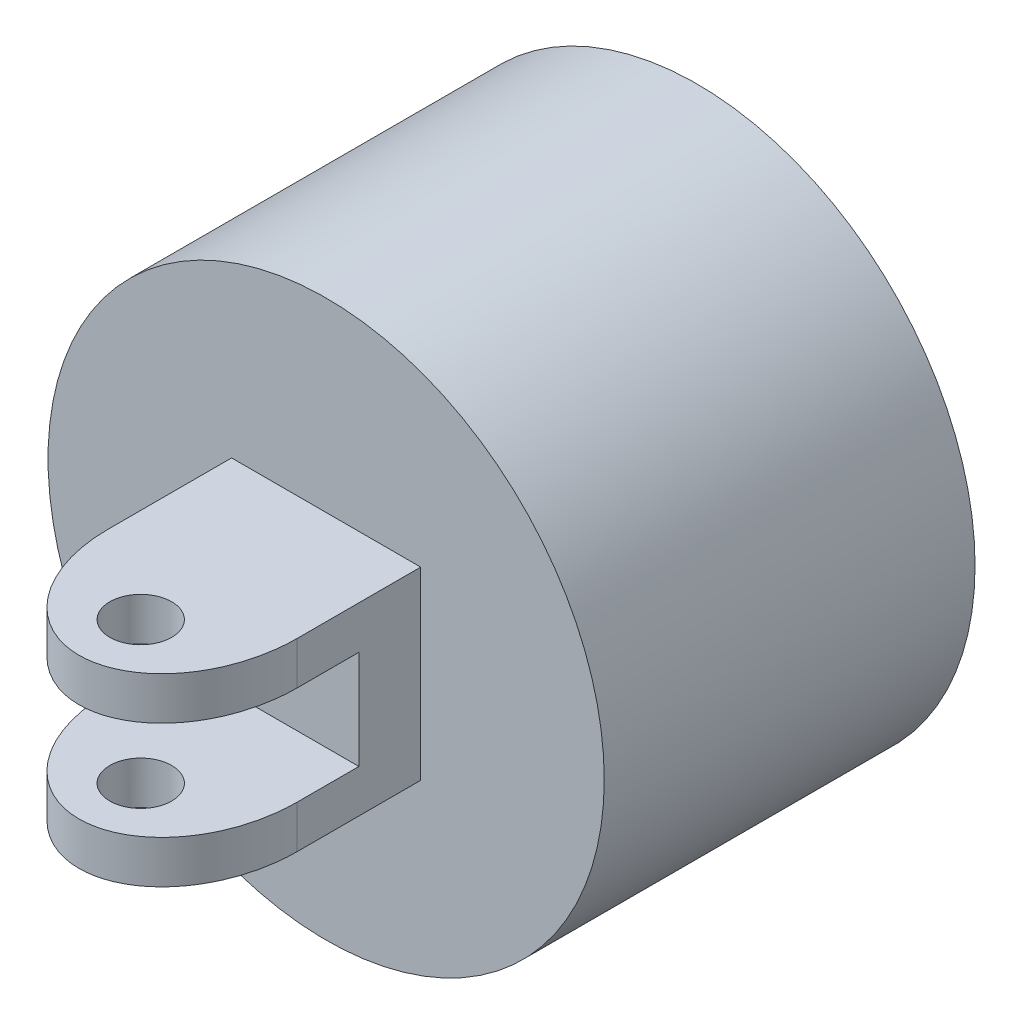
ISO-10303-21;
HEADER;
FILE_DESCRIPTION(('STEP AP214'),'2;1');
FILE_NAME('part.step','',(''),(''),'','','');
FILE_SCHEMA(('AUTOMOTIVE_DESIGN { 1 0 10303 214 1 1 1 1 }'));
ENDSEC;
DATA;
#1=APPLICATION_CONTEXT('core data for automotive mechanical design processes');
#2=APPLICATION_PROTOCOL_DEFINITION('international standard','automotive_design',2000,#1);
#3=PRODUCT_CONTEXT('',#1,'mechanical');
#4=PRODUCT('Part','Part','',(#3));
#5=PRODUCT_RELATED_PRODUCT_CATEGORY('part','',(#4));
#6=PRODUCT_DEFINITION_FORMATION('','',#4);
#7=PRODUCT_DEFINITION_CONTEXT('part definition',#1,'design');
#8=PRODUCT_DEFINITION('design','',#6,#7);
#9=PRODUCT_DEFINITION_SHAPE('','',#8);
#10=(LENGTH_UNIT() NAMED_UNIT(*) SI_UNIT(.MILLI.,.METRE.));
#11=(NAMED_UNIT(*) PLANE_ANGLE_UNIT() SI_UNIT($,.RADIAN.));
#12=(NAMED_UNIT(*) SI_UNIT($,.STERADIAN.) SOLID_ANGLE_UNIT());
#13=UNCERTAINTY_MEASURE_WITH_UNIT(LENGTH_MEASURE(1.E-05),#10,'distance_accuracy_value','');
#14=(GEOMETRIC_REPRESENTATION_CONTEXT(3) GLOBAL_UNCERTAINTY_ASSIGNED_CONTEXT((#13)) GLOBAL_UNIT_ASSIGNED_CONTEXT((#10,
#11,#12)) REPRESENTATION_CONTEXT('',''));
#15=CARTESIAN_POINT('',(0.,0.,0.));
#16=DIRECTION('',(0.,0.,1.));
#17=DIRECTION('',(1.,0.,0.));
#18=AXIS2_PLACEMENT_3D('',#15,#16,#17);
#19=CARTESIAN_POINT('',(7.64976715644752,-7.46906399527171,50.));
#20=DIRECTION('',(0.,1.,0.));
#21=DIRECTION('',(0.,0.,1.));
#22=AXIS2_PLACEMENT_3D('',#19,#20,#21);
#23=PLANE('',#22);
#24=CARTESIAN_POINT('',(0.,-7.46906399527171,45.));
#25=DIRECTION('',(0.,1.,0.));
#26=DIRECTION('',(0.,0.,1.));
#27=AXIS2_PLACEMENT_3D('',#24,#25,#26);
#28=CIRCLE('',#27,2.5);
#29=CARTESIAN_POINT('',(0.,-7.46906399527171,47.5));
#30=VERTEX_POINT('',#29);
#31=EDGE_CURVE('E710',#30,#30,#28,.T.);
#32=ORIENTED_EDGE('',*,*,#31,.T.);
#33=EDGE_LOOP('',(#32));
#34=FACE_BOUND('',#33,.T.);
#35=CARTESIAN_POINT('',(0.,-7.46906399527171,40.));
#36=DIRECTION('',(0.,1.,0.));
#37=DIRECTION('',(0.,0.,-1.));
#38=AXIS2_PLACEMENT_3D('',#35,#36,#37);
#39=ELLIPSE('',#38,10.,7.64976715644752);
#40=CARTESIAN_POINT('',(-7.64976715644752,-7.46906399527171,40.));
#41=VERTEX_POINT('',#40);
#42=CARTESIAN_POINT('',(7.64976715644752,-7.46906399527171,40.));
#43=VERTEX_POINT('',#42);
#44=EDGE_CURVE('E687',#41,#43,#39,.T.);
#45=ORIENTED_EDGE('',*,*,#44,.F.);
#46=DIRECTION('',(0.,0.,-1.));
#47=VECTOR('',#46,1.);
#48=CARTESIAN_POINT('',(-7.64976715644752,-7.46906399527171,50.));
#49=LINE('',#48,#47);
#50=CARTESIAN_POINT('',(-7.64976715644752,-7.46906399527171,30.));
#51=VERTEX_POINT('',#50);
#52=EDGE_CURVE('E462',#41,#51,#49,.T.);
#53=ORIENTED_EDGE('',*,*,#52,.T.);
#54=DIRECTION('',(1.,0.,0.));
#55=VECTOR('',#54,1.);
#56=CARTESIAN_POINT('',(7.64976715644752,-7.46906399527171,30.));
#57=LINE('',#56,#55);
#58=CARTESIAN_POINT('',(7.64976715644752,-7.46906399527171,30.));
#59=VERTEX_POINT('',#58);
#60=EDGE_CURVE('E676',#51,#59,#57,.T.);
#61=ORIENTED_EDGE('',*,*,#60,.T.);
#62=DIRECTION('',(0.,0.,-1.));
#63=VECTOR('',#62,1.);
#64=CARTESIAN_POINT('',(7.64976715644752,-7.46906399527171,50.));
#65=LINE('',#64,#63);
#66=EDGE_CURVE('E454',#43,#59,#65,.T.);
#67=ORIENTED_EDGE('',*,*,#66,.F.);
#68=EDGE_LOOP('',(#45,#53,#61,#67));
#69=FACE_BOUND('',#68,.T.);
#70=ADVANCED_FACE('F264',(#34,#69),#23,.F.);
#71=CARTESIAN_POINT('',(7.64976715644752,7.46906399527171,50.));
#72=DIRECTION('',(0.,-1.,0.));
#73=DIRECTION('',(0.,0.,-1.));
#74=AXIS2_PLACEMENT_3D('',#71,#72,#73);
#75=PLANE('',#74);
#76=CARTESIAN_POINT('',(0.,7.46906399527171,45.));
#77=DIRECTION('',(0.,1.,0.));
#78=DIRECTION('',(0.,0.,1.));
#79=AXIS2_PLACEMENT_3D('',#76,#77,#78);
#80=CIRCLE('',#79,2.5);
#81=CARTESIAN_POINT('',(0.,7.46906399527171,47.5));
#82=VERTEX_POINT('',#81);
#83=EDGE_CURVE('E647',#82,#82,#80,.T.);
#84=ORIENTED_EDGE('',*,*,#83,.F.);
#85=EDGE_LOOP('',(#84));
#86=FACE_BOUND('',#85,.T.);
#87=DIRECTION('',(0.,0.,-1.));
#88=VECTOR('',#87,1.);
#89=CARTESIAN_POINT('',(-7.64976715644752,7.46906399527171,50.));
#90=LINE('',#89,#88);
#91=CARTESIAN_POINT('',(-7.64976715644752,7.46906399527171,40.));
#92=VERTEX_POINT('',#91);
#93=CARTESIAN_POINT('',(-7.64976715644752,7.46906399527171,30.));
#94=VERTEX_POINT('',#93);
#95=EDGE_CURVE('E290',#92,#94,#90,.T.);
#96=ORIENTED_EDGE('',*,*,#95,.F.);
#97=CARTESIAN_POINT('',(0.,7.46906399527171,40.));
#98=DIRECTION('',(0.,1.,0.));
#99=DIRECTION('',(0.,0.,-1.));
#100=AXIS2_PLACEMENT_3D('',#97,#98,#99);
#101=ELLIPSE('',#100,10.,7.64976715644752);
#102=CARTESIAN_POINT('',(7.64976715644752,7.46906399527171,40.));
#103=VERTEX_POINT('',#102);
#104=EDGE_CURVE('E430',#92,#103,#101,.T.);
#105=ORIENTED_EDGE('',*,*,#104,.T.);
#106=DIRECTION('',(0.,0.,-1.));
#107=VECTOR('',#106,1.);
#108=CARTESIAN_POINT('',(7.64976715644752,7.46906399527171,50.));
#109=LINE('',#108,#107);
#110=CARTESIAN_POINT('',(7.64976715644752,7.46906399527171,30.));
#111=VERTEX_POINT('',#110);
#112=EDGE_CURVE('E450',#103,#111,#109,.T.);
#113=ORIENTED_EDGE('',*,*,#112,.T.);
#114=DIRECTION('',(-1.,0.,0.));
#115=VECTOR('',#114,1.);
#116=CARTESIAN_POINT('',(7.64976715644752,7.46906399527171,30.));
#117=LINE('',#116,#115);
#118=EDGE_CURVE('E448',#111,#94,#117,.T.);
#119=ORIENTED_EDGE('',*,*,#118,.T.);
#120=EDGE_LOOP('',(#96,#105,#113,#119));
#121=FACE_BOUND('',#120,.T.);
#122=ADVANCED_FACE('F446',(#86,#121),#75,.F.);
#123=CARTESIAN_POINT('',(12.3502328435525,-4.,50.));
#124=DIRECTION('',(0.,-1.,0.));
#125=DIRECTION('',(0.,0.,-1.));
#126=AXIS2_PLACEMENT_3D('',#123,#124,#125);
#127=PLANE('',#126);
#128=CARTESIAN_POINT('',(0.,-4.,45.));
#129=DIRECTION('',(0.,-1.,0.));
#130=DIRECTION('',(0.,0.,-1.));
#131=AXIS2_PLACEMENT_3D('',#128,#129,#130);
#132=CIRCLE('',#131,2.5);
#133=CARTESIAN_POINT('',(0.,-4.,42.5));
#134=VERTEX_POINT('',#133);
#135=EDGE_CURVE('E646',#134,#134,#132,.T.);
#136=ORIENTED_EDGE('',*,*,#135,.T.);
#137=EDGE_LOOP('',(#136));
#138=FACE_BOUND('',#137,.T.);
#139=DIRECTION('',(0.,0.,1.));
#140=VECTOR('',#139,1.);
#141=CARTESIAN_POINT('',(-7.64976715644752,-4.,50.));
#142=LINE('',#141,#140);
#143=CARTESIAN_POINT('',(-7.64976715644752,-4.,35.));
#144=VERTEX_POINT('',#143);
#145=CARTESIAN_POINT('',(-7.64976715644752,-4.,40.));
#146=VERTEX_POINT('',#145);
#147=EDGE_CURVE('E691',#144,#146,#142,.T.);
#148=ORIENTED_EDGE('',*,*,#147,.T.);
#149=CARTESIAN_POINT('',(0.,-4.,40.));
#150=DIRECTION('',(0.,1.,0.));
#151=DIRECTION('',(0.,0.,-1.));
#152=AXIS2_PLACEMENT_3D('',#149,#150,#151);
#153=ELLIPSE('',#152,10.,7.64976715644752);
#154=CARTESIAN_POINT('',(7.64976715644752,-4.,40.));
#155=VERTEX_POINT('',#154);
#156=EDGE_CURVE('E694',#155,#146,#153,.F.);
#157=ORIENTED_EDGE('',*,*,#156,.F.);
#158=DIRECTION('',(0.,0.,1.));
#159=VECTOR('',#158,1.);
#160=CARTESIAN_POINT('',(7.64976715644752,-4.,50.));
#161=LINE('',#160,#159);
#162=CARTESIAN_POINT('',(7.64976715644752,-4.,35.));
#163=VERTEX_POINT('',#162);
#164=EDGE_CURVE('E663',#163,#155,#161,.T.);
#165=ORIENTED_EDGE('',*,*,#164,.F.);
#166=DIRECTION('',(-1.,0.,0.));
#167=VECTOR('',#166,1.);
#168=CARTESIAN_POINT('',(12.3502328435525,-4.,35.));
#169=LINE('',#168,#167);
#170=EDGE_CURVE('E664',#163,#144,#169,.T.);
#171=ORIENTED_EDGE('',*,*,#170,.T.);
#172=EDGE_LOOP('',(#148,#157,#165,#171));
#173=FACE_BOUND('',#172,.T.);
#174=ADVANCED_FACE('F693',(#138,#173),#127,.F.);
#175=CARTESIAN_POINT('',(12.3502328435525,4.,35.));
#176=DIRECTION('',(0.,1.,0.));
#177=DIRECTION('',(0.,0.,1.));
#178=AXIS2_PLACEMENT_3D('',#175,#176,#177);
#179=PLANE('',#178);
#180=CARTESIAN_POINT('',(0.,4.,45.));
#181=DIRECTION('',(0.,1.,0.));
#182=DIRECTION('',(0.,0.,1.));
#183=AXIS2_PLACEMENT_3D('',#180,#181,#182);
#184=CIRCLE('',#183,2.5);
#185=CARTESIAN_POINT('',(0.,4.,47.5));
#186=VERTEX_POINT('',#185);
#187=EDGE_CURVE('E643',#186,#186,#184,.T.);
#188=ORIENTED_EDGE('',*,*,#187,.T.);
#189=EDGE_LOOP('',(#188));
#190=FACE_BOUND('',#189,.T.);
#191=CARTESIAN_POINT('',(0.,4.,40.));
#192=DIRECTION('',(0.,1.,0.));
#193=DIRECTION('',(0.,0.,-1.));
#194=AXIS2_PLACEMENT_3D('',#191,#192,#193);
#195=ELLIPSE('',#194,10.,7.64976715644752);
#196=CARTESIAN_POINT('',(-7.64976715644752,4.,40.));
#197=VERTEX_POINT('',#196);
#198=CARTESIAN_POINT('',(7.64976715644752,4.,40.));
#199=VERTEX_POINT('',#198);
#200=EDGE_CURVE('E444',#197,#199,#195,.T.);
#201=ORIENTED_EDGE('',*,*,#200,.F.);
#202=DIRECTION('',(0.,0.,-1.));
#203=VECTOR('',#202,1.);
#204=CARTESIAN_POINT('',(-7.64976715644752,4.,35.));
#205=LINE('',#204,#203);
#206=CARTESIAN_POINT('',(-7.64976715644752,4.,35.));
#207=VERTEX_POINT('',#206);
#208=EDGE_CURVE('E442',#197,#207,#205,.T.);
#209=ORIENTED_EDGE('',*,*,#208,.T.);
#210=DIRECTION('',(-1.,0.,0.));
#211=VECTOR('',#210,1.);
#212=CARTESIAN_POINT('',(12.3502328435525,4.,35.));
#213=LINE('',#212,#211);
#214=CARTESIAN_POINT('',(7.64976715644752,4.,35.));
#215=VERTEX_POINT('',#214);
#216=EDGE_CURVE('E661',#215,#207,#213,.T.);
#217=ORIENTED_EDGE('',*,*,#216,.F.);
#218=DIRECTION('',(0.,0.,-1.));
#219=VECTOR('',#218,1.);
#220=CARTESIAN_POINT('',(7.64976715644752,4.,50.));
#221=LINE('',#220,#219);
#222=EDGE_CURVE('E653',#199,#215,#221,.T.);
#223=ORIENTED_EDGE('',*,*,#222,.F.);
#224=EDGE_LOOP('',(#201,#209,#217,#223));
#225=FACE_BOUND('',#224,.T.);
#226=ADVANCED_FACE('F659',(#190,#225),#179,.F.);
#227=CARTESIAN_POINT('',(7.64976715644752,-7.46906399527171,50.));
#228=DIRECTION('',(-1.,0.,0.));
#229=DIRECTION('',(0.,0.,1.));
#230=AXIS2_PLACEMENT_3D('',#227,#228,#229);
#231=PLANE('',#230);
#232=DIRECTION('',(0.,1.,0.));
#233=VECTOR('',#232,1.);
#234=CARTESIAN_POINT('',(7.64976715644752,-12.5309360047283,40.));
#235=LINE('',#234,#233);
#236=EDGE_CURVE('E282',#43,#155,#235,.T.);
#237=ORIENTED_EDGE('',*,*,#236,.F.);
#238=ORIENTED_EDGE('',*,*,#66,.T.);
#239=DIRECTION('',(0.,1.,0.));
#240=VECTOR('',#239,1.);
#241=CARTESIAN_POINT('',(7.64976715644752,-7.46906399527171,30.));
#242=LINE('',#241,#240);
#243=EDGE_CURVE('E456',#59,#111,#242,.T.);
#244=ORIENTED_EDGE('',*,*,#243,.T.);
#245=ORIENTED_EDGE('',*,*,#112,.F.);
#246=EDGE_CURVE('E434',#199,#103,#235,.T.);
#247=ORIENTED_EDGE('',*,*,#246,.F.);
#248=ORIENTED_EDGE('',*,*,#222,.T.);
#249=DIRECTION('',(0.,-1.,0.));
#250=VECTOR('',#249,1.);
#251=CARTESIAN_POINT('',(7.64976715644752,-7.46906399527171,35.));
#252=LINE('',#251,#250);
#253=EDGE_CURVE('E636',#215,#163,#252,.T.);
#254=ORIENTED_EDGE('',*,*,#253,.T.);
#255=ORIENTED_EDGE('',*,*,#164,.T.);
#256=EDGE_LOOP('',(#237,#238,#244,#245,#247,#248,#254,#255));
#257=FACE_BOUND('',#256,.T.);
#258=ADVANCED_FACE('F652',(#257),#231,.F.);
#259=CARTESIAN_POINT('',(0.,0.,30.));
#260=DIRECTION('',(0.,0.,-1.));
#261=DIRECTION('',(-1.,0.,0.));
#262=AXIS2_PLACEMENT_3D('',#259,#260,#261);
#263=CYLINDRICAL_SURFACE('',#262,22.5);
#264=CARTESIAN_POINT('',(0.,0.,30.));
#265=DIRECTION('',(0.,0.,1.));
#266=DIRECTION('',(1.,0.,0.));
#267=AXIS2_PLACEMENT_3D('',#264,#265,#266);
#268=CIRCLE('',#267,22.5);
#269=CARTESIAN_POINT('',(22.5,0.,30.));
#270=VERTEX_POINT('',#269);
#271=EDGE_CURVE('E632',#270,#270,#268,.T.);
#272=ORIENTED_EDGE('',*,*,#271,.F.);
#273=EDGE_LOOP('',(#272));
#274=FACE_BOUND('',#273,.T.);
#275=CARTESIAN_POINT('',(0.,0.,0.));
#276=DIRECTION('',(0.,0.,1.));
#277=DIRECTION('',(1.,0.,0.));
#278=AXIS2_PLACEMENT_3D('',#275,#276,#277);
#279=CIRCLE('',#278,22.5);
#280=CARTESIAN_POINT('',(22.5,0.,0.));
#281=VERTEX_POINT('',#280);
#282=EDGE_CURVE('E511',#281,#281,#279,.T.);
#283=ORIENTED_EDGE('',*,*,#282,.T.);
#284=EDGE_LOOP('',(#283));
#285=FACE_BOUND('',#284,.T.);
#286=ADVANCED_FACE('F266',(#274,#285),#263,.T.);
#287=CARTESIAN_POINT('',(0.,0.,30.));
#288=DIRECTION('',(0.,0.,1.));
#289=DIRECTION('',(1.,0.,0.));
#290=AXIS2_PLACEMENT_3D('',#287,#288,#289);
#291=PLANE('',#290);
#292=DIRECTION('',(0.,-1.,0.));
#293=VECTOR('',#292,1.);
#294=CARTESIAN_POINT('',(-7.64976715644752,-7.46906399527171,30.));
#295=LINE('',#294,#293);
#296=EDGE_CURVE('E669',#94,#51,#295,.T.);
#297=ORIENTED_EDGE('',*,*,#296,.F.);
#298=ORIENTED_EDGE('',*,*,#118,.F.);
#299=ORIENTED_EDGE('',*,*,#243,.F.);
#300=ORIENTED_EDGE('',*,*,#60,.F.);
#301=EDGE_LOOP('',(#297,#298,#299,#300));
#302=FACE_BOUND('',#301,.T.);
#303=ORIENTED_EDGE('',*,*,#271,.T.);
#304=EDGE_LOOP('',(#303));
#305=FACE_BOUND('',#304,.T.);
#306=ADVANCED_FACE('F684',(#302,#305),#291,.T.);
#307=CARTESIAN_POINT('',(0.,0.,0.));
#308=DIRECTION('',(0.,0.,1.));
#309=DIRECTION('',(1.,0.,0.));
#310=AXIS2_PLACEMENT_3D('',#307,#308,#309);
#311=PLANE('',#310);
#312=DIRECTION('',(0.,1.,0.));
#313=VECTOR('',#312,1.);
#314=CARTESIAN_POINT('',(-1.5,0.,0.));
#315=LINE('',#314,#313);
#316=CARTESIAN_POINT('',(-1.50000000000003,7.34846922834953,0.));
#317=VERTEX_POINT('',#316);
#318=CARTESIAN_POINT('',(-1.50000000000005,15.,0.));
#319=VERTEX_POINT('',#318);
#320=EDGE_CURVE('E500',#317,#319,#315,.T.);
#321=ORIENTED_EDGE('',*,*,#320,.F.);
#322=CARTESIAN_POINT('',(0.,0.,0.));
#323=DIRECTION('',(0.,0.,-1.));
#324=DIRECTION('',(-1.,0.,0.));
#325=AXIS2_PLACEMENT_3D('',#322,#323,#324);
#326=CIRCLE('',#325,7.5);
#327=CARTESIAN_POINT('',(-7.34846922834953,1.5,0.));
#328=VERTEX_POINT('',#327);
#329=EDGE_CURVE('E496',#328,#317,#326,.T.);
#330=ORIENTED_EDGE('',*,*,#329,.F.);
#331=DIRECTION('',(1.,0.,0.));
#332=VECTOR('',#331,1.);
#333=CARTESIAN_POINT('',(-15.,1.5,0.));
#334=LINE('',#333,#332);
#335=CARTESIAN_POINT('',(-15.,1.5,0.));
#336=VERTEX_POINT('',#335);
#337=EDGE_CURVE('E581',#336,#328,#334,.T.);
#338=ORIENTED_EDGE('',*,*,#337,.F.);
#339=DIRECTION('',(0.,1.,0.));
#340=VECTOR('',#339,1.);
#341=CARTESIAN_POINT('',(-15.,-1.5,0.));
#342=LINE('',#341,#340);
#343=CARTESIAN_POINT('',(-15.,-1.5,0.));
#344=VERTEX_POINT('',#343);
#345=EDGE_CURVE('E575',#344,#336,#342,.T.);
#346=ORIENTED_EDGE('',*,*,#345,.F.);
#347=DIRECTION('',(1.,0.,0.));
#348=VECTOR('',#347,1.);
#349=CARTESIAN_POINT('',(-15.,-1.5,0.));
#350=LINE('',#349,#348);
#351=CARTESIAN_POINT('',(-7.34846922834953,-1.5,0.));
#352=VERTEX_POINT('',#351);
#353=EDGE_CURVE('E560',#344,#352,#350,.T.);
#354=ORIENTED_EDGE('',*,*,#353,.T.);
#355=CARTESIAN_POINT('',(0.,0.,0.));
#356=DIRECTION('',(0.,0.,-1.));
#357=DIRECTION('',(-1.,0.,0.));
#358=AXIS2_PLACEMENT_3D('',#355,#356,#357);
#359=CIRCLE('',#358,7.5);
#360=CARTESIAN_POINT('',(-1.49999999999998,-7.34846922834954,0.));
#361=VERTEX_POINT('',#360);
#362=EDGE_CURVE('E546',#361,#352,#359,.T.);
#363=ORIENTED_EDGE('',*,*,#362,.F.);
#364=DIRECTION('',(0.,1.,0.));
#365=VECTOR('',#364,1.);
#366=CARTESIAN_POINT('',(-1.49999999999995,-15.,0.));
#367=LINE('',#366,#365);
#368=CARTESIAN_POINT('',(-1.49999999999995,-15.,0.));
#369=VERTEX_POINT('',#368);
#370=EDGE_CURVE('E621',#369,#361,#367,.T.);
#371=ORIENTED_EDGE('',*,*,#370,.F.);
#372=DIRECTION('',(-1.,0.,0.));
#373=VECTOR('',#372,1.);
#374=CARTESIAN_POINT('',(1.50000000000005,-15.,0.));
#375=LINE('',#374,#373);
#376=CARTESIAN_POINT('',(1.50000000000005,-15.,0.));
#377=VERTEX_POINT('',#376);
#378=EDGE_CURVE('E465',#377,#369,#375,.T.);
#379=ORIENTED_EDGE('',*,*,#378,.F.);
#380=DIRECTION('',(0.,1.,0.));
#381=VECTOR('',#380,1.);
#382=CARTESIAN_POINT('',(1.50000000000005,-15.,0.));
#383=LINE('',#382,#381);
#384=CARTESIAN_POINT('',(1.50000000000002,-7.34846922834953,0.));
#385=VERTEX_POINT('',#384);
#386=EDGE_CURVE('E609',#377,#385,#383,.T.);
#387=ORIENTED_EDGE('',*,*,#386,.T.);
#388=CARTESIAN_POINT('',(0.,0.,0.));
#389=DIRECTION('',(0.,0.,-1.));
#390=DIRECTION('',(-1.,0.,0.));
#391=AXIS2_PLACEMENT_3D('',#388,#389,#390);
#392=CIRCLE('',#391,7.5);
#393=CARTESIAN_POINT('',(7.34846922834953,-1.5,0.));
#394=VERTEX_POINT('',#393);
#395=EDGE_CURVE('E532',#394,#385,#392,.T.);
#396=ORIENTED_EDGE('',*,*,#395,.F.);
#397=CARTESIAN_POINT('',(15.,-1.5,0.));
#398=VERTEX_POINT('',#397);
#399=EDGE_CURVE('E589',#394,#398,#350,.T.);
#400=ORIENTED_EDGE('',*,*,#399,.T.);
#401=DIRECTION('',(0.,1.,0.));
#402=VECTOR('',#401,1.);
#403=CARTESIAN_POINT('',(15.,-1.5,0.));
#404=LINE('',#403,#402);
#405=CARTESIAN_POINT('',(15.,1.5,0.));
#406=VERTEX_POINT('',#405);
#407=EDGE_CURVE('E585',#398,#406,#404,.T.);
#408=ORIENTED_EDGE('',*,*,#407,.T.);
#409=CARTESIAN_POINT('',(7.34846922834953,1.5,0.));
#410=VERTEX_POINT('',#409);
#411=EDGE_CURVE('E579',#410,#406,#334,.T.);
#412=ORIENTED_EDGE('',*,*,#411,.F.);
#413=CARTESIAN_POINT('',(0.,0.,0.));
#414=DIRECTION('',(0.,0.,-1.));
#415=DIRECTION('',(-1.,0.,0.));
#416=AXIS2_PLACEMENT_3D('',#413,#414,#415);
#417=CIRCLE('',#416,7.5);
#418=CARTESIAN_POINT('',(1.49999999999997,7.34846922834954,0.));
#419=VERTEX_POINT('',#418);
#420=EDGE_CURVE('E491',#419,#410,#417,.T.);
#421=ORIENTED_EDGE('',*,*,#420,.F.);
#422=DIRECTION('',(0.,1.,0.));
#423=VECTOR('',#422,1.);
#424=CARTESIAN_POINT('',(1.5,0.,0.));
#425=LINE('',#424,#423);
#426=CARTESIAN_POINT('',(1.49999999999995,15.,0.));
#427=VERTEX_POINT('',#426);
#428=EDGE_CURVE('E487',#419,#427,#425,.T.);
#429=ORIENTED_EDGE('',*,*,#428,.T.);
#430=DIRECTION('',(-1.,0.,0.));
#431=VECTOR('',#430,1.);
#432=CARTESIAN_POINT('',(0.,15.,0.));
#433=LINE('',#432,#431);
#434=EDGE_CURVE('E471',#427,#319,#433,.T.);
#435=ORIENTED_EDGE('',*,*,#434,.T.);
#436=EDGE_LOOP('',(#321,#330,#338,#346,#354,#363,#371,#379,#387,#396,#400,#408,#412,#421,#429,#435));
#437=FACE_BOUND('',#436,.T.);
#438=ORIENTED_EDGE('',*,*,#282,.F.);
#439=EDGE_LOOP('',(#438));
#440=FACE_BOUND('',#439,.T.);
#441=ADVANCED_FACE('F765',(#437,#440),#311,.F.);
#442=CARTESIAN_POINT('',(-1.5,0.,10.));
#443=DIRECTION('',(-1.,0.,0.));
#444=DIRECTION('',(0.,-1.,0.));
#445=AXIS2_PLACEMENT_3D('',#442,#443,#444);
#446=PLANE('',#445);
#447=ORIENTED_EDGE('',*,*,#320,.T.);
#448=DIRECTION('',(0.,0.,-1.));
#449=VECTOR('',#448,1.);
#450=CARTESIAN_POINT('',(-1.50000000000005,15.,10.));
#451=LINE('',#450,#449);
#452=CARTESIAN_POINT('',(-1.50000000000005,15.,10.));
#453=VERTEX_POINT('',#452);
#454=EDGE_CURVE('E512',#453,#319,#451,.T.);
#455=ORIENTED_EDGE('',*,*,#454,.F.);
#456=DIRECTION('',(0.,1.,0.));
#457=VECTOR('',#456,1.);
#458=CARTESIAN_POINT('',(-1.5,0.,10.));
#459=LINE('',#458,#457);
#460=CARTESIAN_POINT('',(-1.50000000000003,7.34846922834953,10.));
#461=VERTEX_POINT('',#460);
#462=EDGE_CURVE('E479',#461,#453,#459,.T.);
#463=ORIENTED_EDGE('',*,*,#462,.F.);
#464=DIRECTION('',(0.,0.,-1.));
#465=VECTOR('',#464,1.);
#466=CARTESIAN_POINT('',(-1.50000000000003,7.34846922834953,10.));
#467=LINE('',#466,#465);
#468=EDGE_CURVE('E515',#461,#317,#467,.T.);
#469=ORIENTED_EDGE('',*,*,#468,.T.);
#470=EDGE_LOOP('',(#447,#455,#463,#469));
#471=FACE_BOUND('',#470,.T.);
#472=ADVANCED_FACE('F757',(#471),#446,.F.);
#473=CARTESIAN_POINT('',(1.5,0.,10.));
#474=DIRECTION('',(-1.,0.,0.));
#475=DIRECTION('',(0.,-1.,0.));
#476=AXIS2_PLACEMENT_3D('',#473,#474,#475);
#477=PLANE('',#476);
#478=ORIENTED_EDGE('',*,*,#428,.F.);
#479=DIRECTION('',(0.,0.,-1.));
#480=VECTOR('',#479,1.);
#481=CARTESIAN_POINT('',(1.49999999999997,7.34846922834954,10.));
#482=LINE('',#481,#480);
#483=CARTESIAN_POINT('',(1.49999999999997,7.34846922834954,10.));
#484=VERTEX_POINT('',#483);
#485=EDGE_CURVE('E486',#484,#419,#482,.T.);
#486=ORIENTED_EDGE('',*,*,#485,.F.);
#487=DIRECTION('',(0.,1.,0.));
#488=VECTOR('',#487,1.);
#489=CARTESIAN_POINT('',(1.5,0.,10.));
#490=LINE('',#489,#488);
#491=CARTESIAN_POINT('',(1.49999999999995,15.,10.));
#492=VERTEX_POINT('',#491);
#493=EDGE_CURVE('E466',#484,#492,#490,.T.);
#494=ORIENTED_EDGE('',*,*,#493,.T.);
#495=DIRECTION('',(0.,0.,-1.));
#496=VECTOR('',#495,1.);
#497=CARTESIAN_POINT('',(1.49999999999995,15.,10.));
#498=LINE('',#497,#496);
#499=EDGE_CURVE('E507',#492,#427,#498,.T.);
#500=ORIENTED_EDGE('',*,*,#499,.T.);
#501=EDGE_LOOP('',(#478,#486,#494,#500));
#502=FACE_BOUND('',#501,.T.);
#503=ADVANCED_FACE('F761',(#502),#477,.T.);
#504=CARTESIAN_POINT('',(0.,15.,10.));
#505=DIRECTION('',(0.,-1.,0.));
#506=DIRECTION('',(1.,0.,0.));
#507=AXIS2_PLACEMENT_3D('',#504,#505,#506);
#508=PLANE('',#507);
#509=ORIENTED_EDGE('',*,*,#434,.F.);
#510=ORIENTED_EDGE('',*,*,#499,.F.);
#511=DIRECTION('',(-1.,0.,0.));
#512=VECTOR('',#511,1.);
#513=CARTESIAN_POINT('',(0.,15.,10.));
#514=LINE('',#513,#512);
#515=EDGE_CURVE('E483',#492,#453,#514,.T.);
#516=ORIENTED_EDGE('',*,*,#515,.T.);
#517=ORIENTED_EDGE('',*,*,#454,.T.);
#518=EDGE_LOOP('',(#509,#510,#516,#517));
#519=FACE_BOUND('',#518,.T.);
#520=ADVANCED_FACE('F751',(#519),#508,.T.);
#521=CARTESIAN_POINT('',(0.,0.,10.));
#522=DIRECTION('',(0.,0.,-1.));
#523=DIRECTION('',(-1.,0.,0.));
#524=AXIS2_PLACEMENT_3D('',#521,#522,#523);
#525=CYLINDRICAL_SURFACE('',#524,7.5);
#526=ORIENTED_EDGE('',*,*,#362,.T.);
#527=DIRECTION('',(0.,0.,-1.));
#528=VECTOR('',#527,1.);
#529=CARTESIAN_POINT('',(-7.34846922834953,-1.5,10.));
#530=LINE('',#529,#528);
#531=CARTESIAN_POINT('',(-7.34846922834953,-1.5,10.));
#532=VERTEX_POINT('',#531);
#533=EDGE_CURVE('E536',#532,#352,#530,.T.);
#534=ORIENTED_EDGE('',*,*,#533,.F.);
#535=CARTESIAN_POINT('',(0.,0.,10.));
#536=DIRECTION('',(0.,0.,-1.));
#537=DIRECTION('',(-1.,0.,0.));
#538=AXIS2_PLACEMENT_3D('',#535,#536,#537);
#539=CIRCLE('',#538,7.5);
#540=CARTESIAN_POINT('',(-1.49999999999998,-7.34846922834954,10.));
#541=VERTEX_POINT('',#540);
#542=EDGE_CURVE('E541',#541,#532,#539,.T.);
#543=ORIENTED_EDGE('',*,*,#542,.F.);
#544=DIRECTION('',(0.,0.,-1.));
#545=VECTOR('',#544,1.);
#546=CARTESIAN_POINT('',(-1.49999999999998,-7.34846922834954,10.));
#547=LINE('',#546,#545);
#548=EDGE_CURVE('E545',#541,#361,#547,.T.);
#549=ORIENTED_EDGE('',*,*,#548,.T.);
#550=EDGE_LOOP('',(#526,#534,#543,#549));
#551=FACE_BOUND('',#550,.T.);
#552=ADVANCED_FACE('F760',(#551),#525,.F.);
#553=CARTESIAN_POINT('',(-1.49999999999995,-15.,10.));
#554=DIRECTION('',(-1.,0.,0.));
#555=DIRECTION('',(0.,-1.,0.));
#556=AXIS2_PLACEMENT_3D('',#553,#554,#555);
#557=PLANE('',#556);
#558=DIRECTION('',(0.,1.,0.));
#559=VECTOR('',#558,1.);
#560=CARTESIAN_POINT('',(-1.49999999999995,-15.,10.));
#561=LINE('',#560,#559);
#562=CARTESIAN_POINT('',(-1.49999999999995,-15.,10.));
#563=VERTEX_POINT('',#562);
#564=EDGE_CURVE('E608',#563,#541,#561,.T.);
#565=ORIENTED_EDGE('',*,*,#564,.F.);
#566=DIRECTION('',(0.,0.,-1.));
#567=VECTOR('',#566,1.);
#568=CARTESIAN_POINT('',(-1.49999999999995,-15.,10.));
#569=LINE('',#568,#567);
#570=EDGE_CURVE('E617',#563,#369,#569,.T.);
#571=ORIENTED_EDGE('',*,*,#570,.T.);
#572=ORIENTED_EDGE('',*,*,#370,.T.);
#573=ORIENTED_EDGE('',*,*,#548,.F.);
#574=EDGE_LOOP('',(#565,#571,#572,#573));
#575=FACE_BOUND('',#574,.T.);
#576=ADVANCED_FACE('F785',(#575),#557,.F.);
#577=CARTESIAN_POINT('',(1.50000000000005,-15.,10.));
#578=DIRECTION('',(0.,-1.,0.));
#579=DIRECTION('',(1.,0.,0.));
#580=AXIS2_PLACEMENT_3D('',#577,#578,#579);
#581=PLANE('',#580);
#582=ORIENTED_EDGE('',*,*,#378,.T.);
#583=ORIENTED_EDGE('',*,*,#570,.F.);
#584=DIRECTION('',(-1.,0.,0.));
#585=VECTOR('',#584,1.);
#586=CARTESIAN_POINT('',(1.50000000000005,-15.,10.));
#587=LINE('',#586,#585);
#588=CARTESIAN_POINT('',(1.50000000000005,-15.,10.));
#589=VERTEX_POINT('',#588);
#590=EDGE_CURVE('E604',#589,#563,#587,.T.);
#591=ORIENTED_EDGE('',*,*,#590,.F.);
#592=DIRECTION('',(0.,0.,-1.));
#593=VECTOR('',#592,1.);
#594=CARTESIAN_POINT('',(1.50000000000005,-15.,10.));
#595=LINE('',#594,#593);
#596=EDGE_CURVE('E580',#589,#377,#595,.T.);
#597=ORIENTED_EDGE('',*,*,#596,.T.);
#598=EDGE_LOOP('',(#582,#583,#591,#597));
#599=FACE_BOUND('',#598,.T.);
#600=ADVANCED_FACE('F805',(#599),#581,.F.);
#601=CARTESIAN_POINT('',(1.50000000000005,-15.,10.));
#602=DIRECTION('',(-1.,0.,0.));
#603=DIRECTION('',(0.,-1.,0.));
#604=AXIS2_PLACEMENT_3D('',#601,#602,#603);
#605=PLANE('',#604);
#606=DIRECTION('',(0.,0.,-1.));
#607=VECTOR('',#606,1.);
#608=CARTESIAN_POINT('',(1.50000000000002,-7.34846922834953,10.));
#609=LINE('',#608,#607);
#610=CARTESIAN_POINT('',(1.50000000000002,-7.34846922834953,10.));
#611=VERTEX_POINT('',#610);
#612=EDGE_CURVE('E492',#611,#385,#609,.T.);
#613=ORIENTED_EDGE('',*,*,#612,.T.);
#614=ORIENTED_EDGE('',*,*,#386,.F.);
#615=ORIENTED_EDGE('',*,*,#596,.F.);
#616=DIRECTION('',(0.,1.,0.));
#617=VECTOR('',#616,1.);
#618=CARTESIAN_POINT('',(1.50000000000005,-15.,10.));
#619=LINE('',#618,#617);
#620=EDGE_CURVE('E613',#589,#611,#619,.T.);
#621=ORIENTED_EDGE('',*,*,#620,.T.);
#622=EDGE_LOOP('',(#613,#614,#615,#621));
#623=FACE_BOUND('',#622,.T.);
#624=ADVANCED_FACE('F781',(#623),#605,.T.);
#625=CARTESIAN_POINT('',(0.,0.,10.));
#626=DIRECTION('',(0.,0.,-1.));
#627=DIRECTION('',(-1.,0.,0.));
#628=AXIS2_PLACEMENT_3D('',#625,#626,#627);
#629=CYLINDRICAL_SURFACE('',#628,7.5);
#630=ORIENTED_EDGE('',*,*,#395,.T.);
#631=ORIENTED_EDGE('',*,*,#612,.F.);
#632=CARTESIAN_POINT('',(0.,0.,10.));
#633=DIRECTION('',(0.,0.,-1.));
#634=DIRECTION('',(-1.,0.,0.));
#635=AXIS2_PLACEMENT_3D('',#632,#633,#634);
#636=CIRCLE('',#635,7.5);
#637=CARTESIAN_POINT('',(7.34846922834953,-1.5,10.));
#638=VERTEX_POINT('',#637);
#639=EDGE_CURVE('E527',#638,#611,#636,.T.);
#640=ORIENTED_EDGE('',*,*,#639,.F.);
#641=DIRECTION('',(0.,0.,-1.));
#642=VECTOR('',#641,1.);
#643=CARTESIAN_POINT('',(7.34846922834953,-1.5,10.));
#644=LINE('',#643,#642);
#645=EDGE_CURVE('E531',#638,#394,#644,.T.);
#646=ORIENTED_EDGE('',*,*,#645,.T.);
#647=EDGE_LOOP('',(#630,#631,#640,#646));
#648=FACE_BOUND('',#647,.T.);
#649=ADVANCED_FACE('F777',(#648),#629,.F.);
#650=CARTESIAN_POINT('',(-15.,1.5,10.));
#651=DIRECTION('',(0.,1.,0.));
#652=DIRECTION('',(-1.,0.,0.));
#653=AXIS2_PLACEMENT_3D('',#650,#651,#652);
#654=PLANE('',#653);
#655=DIRECTION('',(1.,0.,0.));
#656=VECTOR('',#655,1.);
#657=CARTESIAN_POINT('',(-15.,1.5,10.));
#658=LINE('',#657,#656);
#659=CARTESIAN_POINT('',(-15.,1.5,10.));
#660=VERTEX_POINT('',#659);
#661=CARTESIAN_POINT('',(-7.34846922834953,1.5,10.));
#662=VERTEX_POINT('',#661);
#663=EDGE_CURVE('E561',#660,#662,#658,.T.);
#664=ORIENTED_EDGE('',*,*,#663,.F.);
#665=DIRECTION('',(0.,0.,-1.));
#666=VECTOR('',#665,1.);
#667=CARTESIAN_POINT('',(-15.,1.5,10.));
#668=LINE('',#667,#666);
#669=EDGE_CURVE('E574',#660,#336,#668,.T.);
#670=ORIENTED_EDGE('',*,*,#669,.T.);
#671=ORIENTED_EDGE('',*,*,#337,.T.);
#672=DIRECTION('',(0.,0.,-1.));
#673=VECTOR('',#672,1.);
#674=CARTESIAN_POINT('',(-7.34846922834953,1.5,10.));
#675=LINE('',#674,#673);
#676=EDGE_CURVE('E518',#662,#328,#675,.T.);
#677=ORIENTED_EDGE('',*,*,#676,.F.);
#678=EDGE_LOOP('',(#664,#670,#671,#677));
#679=FACE_BOUND('',#678,.T.);
#680=ADVANCED_FACE('F780',(#679),#654,.F.);
#681=CARTESIAN_POINT('',(-15.,-1.5,10.));
#682=DIRECTION('',(-1.,0.,0.));
#683=DIRECTION('',(0.,0.,1.));
#684=AXIS2_PLACEMENT_3D('',#681,#682,#683);
#685=PLANE('',#684);
#686=ORIENTED_EDGE('',*,*,#345,.T.);
#687=ORIENTED_EDGE('',*,*,#669,.F.);
#688=DIRECTION('',(0.,1.,0.));
#689=VECTOR('',#688,1.);
#690=CARTESIAN_POINT('',(-15.,-1.5,10.));
#691=LINE('',#690,#689);
#692=CARTESIAN_POINT('',(-15.,-1.5,10.));
#693=VERTEX_POINT('',#692);
#694=EDGE_CURVE('E555',#693,#660,#691,.T.);
#695=ORIENTED_EDGE('',*,*,#694,.F.);
#696=DIRECTION('',(0.,0.,-1.));
#697=VECTOR('',#696,1.);
#698=CARTESIAN_POINT('',(-15.,-1.5,10.));
#699=LINE('',#698,#697);
#700=EDGE_CURVE('E550',#693,#344,#699,.T.);
#701=ORIENTED_EDGE('',*,*,#700,.T.);
#702=EDGE_LOOP('',(#686,#687,#695,#701));
#703=FACE_BOUND('',#702,.T.);
#704=ADVANCED_FACE('F791',(#703),#685,.F.);
#705=CARTESIAN_POINT('',(-15.,-1.5,10.));
#706=DIRECTION('',(0.,1.,0.));
#707=DIRECTION('',(-1.,0.,0.));
#708=AXIS2_PLACEMENT_3D('',#705,#706,#707);
#709=PLANE('',#708);
#710=ORIENTED_EDGE('',*,*,#533,.T.);
#711=ORIENTED_EDGE('',*,*,#353,.F.);
#712=ORIENTED_EDGE('',*,*,#700,.F.);
#713=DIRECTION('',(1.,0.,0.));
#714=VECTOR('',#713,1.);
#715=CARTESIAN_POINT('',(-15.,-1.5,10.));
#716=LINE('',#715,#714);
#717=EDGE_CURVE('E570',#693,#532,#716,.T.);
#718=ORIENTED_EDGE('',*,*,#717,.T.);
#719=EDGE_LOOP('',(#710,#711,#712,#718));
#720=FACE_BOUND('',#719,.T.);
#721=ADVANCED_FACE('F787',(#720),#709,.T.);
#722=ORIENTED_EDGE('',*,*,#645,.F.);
#723=CARTESIAN_POINT('',(15.,-1.5,10.));
#724=VERTEX_POINT('',#723);
#725=EDGE_CURVE('E569',#638,#724,#716,.T.);
#726=ORIENTED_EDGE('',*,*,#725,.T.);
#727=DIRECTION('',(0.,0.,-1.));
#728=VECTOR('',#727,1.);
#729=CARTESIAN_POINT('',(15.,-1.5,10.));
#730=LINE('',#729,#728);
#731=EDGE_CURVE('E595',#724,#398,#730,.T.);
#732=ORIENTED_EDGE('',*,*,#731,.T.);
#733=ORIENTED_EDGE('',*,*,#399,.F.);
#734=EDGE_LOOP('',(#722,#726,#732,#733));
#735=FACE_BOUND('',#734,.T.);
#736=ADVANCED_FACE('F790',(#735),#709,.T.);
#737=CARTESIAN_POINT('',(15.,-1.5,10.));
#738=DIRECTION('',(-1.,0.,0.));
#739=DIRECTION('',(0.,0.,1.));
#740=AXIS2_PLACEMENT_3D('',#737,#738,#739);
#741=PLANE('',#740);
#742=ORIENTED_EDGE('',*,*,#407,.F.);
#743=ORIENTED_EDGE('',*,*,#731,.F.);
#744=DIRECTION('',(0.,1.,0.));
#745=VECTOR('',#744,1.);
#746=CARTESIAN_POINT('',(15.,-1.5,10.));
#747=LINE('',#746,#745);
#748=CARTESIAN_POINT('',(15.,1.5,10.));
#749=VERTEX_POINT('',#748);
#750=EDGE_CURVE('E565',#724,#749,#747,.T.);
#751=ORIENTED_EDGE('',*,*,#750,.T.);
#752=DIRECTION('',(0.,0.,-1.));
#753=VECTOR('',#752,1.);
#754=CARTESIAN_POINT('',(15.,1.5,10.));
#755=LINE('',#754,#753);
#756=EDGE_CURVE('E598',#749,#406,#755,.T.);
#757=ORIENTED_EDGE('',*,*,#756,.T.);
#758=EDGE_LOOP('',(#742,#743,#751,#757));
#759=FACE_BOUND('',#758,.T.);
#760=ADVANCED_FACE('F793',(#759),#741,.T.);
#761=ORIENTED_EDGE('',*,*,#411,.T.);
#762=ORIENTED_EDGE('',*,*,#756,.F.);
#763=CARTESIAN_POINT('',(7.34846922834953,1.5,10.));
#764=VERTEX_POINT('',#763);
#765=EDGE_CURVE('E559',#764,#749,#658,.T.);
#766=ORIENTED_EDGE('',*,*,#765,.F.);
#767=DIRECTION('',(0.,0.,-1.));
#768=VECTOR('',#767,1.);
#769=CARTESIAN_POINT('',(7.34846922834953,1.5,10.));
#770=LINE('',#769,#768);
#771=EDGE_CURVE('E521',#764,#410,#770,.T.);
#772=ORIENTED_EDGE('',*,*,#771,.T.);
#773=EDGE_LOOP('',(#761,#762,#766,#772));
#774=FACE_BOUND('',#773,.T.);
#775=ADVANCED_FACE('F769',(#774),#654,.F.);
#776=CARTESIAN_POINT('',(0.,0.,10.));
#777=DIRECTION('',(0.,0.,-1.));
#778=DIRECTION('',(-1.,0.,0.));
#779=AXIS2_PLACEMENT_3D('',#776,#777,#778);
#780=CYLINDRICAL_SURFACE('',#779,7.5);
#781=ORIENTED_EDGE('',*,*,#329,.T.);
#782=ORIENTED_EDGE('',*,*,#468,.F.);
#783=CARTESIAN_POINT('',(0.,0.,10.));
#784=DIRECTION('',(0.,0.,-1.));
#785=DIRECTION('',(-1.,0.,0.));
#786=AXIS2_PLACEMENT_3D('',#783,#784,#785);
#787=CIRCLE('',#786,7.5);
#788=EDGE_CURVE('E475',#662,#461,#787,.T.);
#789=ORIENTED_EDGE('',*,*,#788,.F.);
#790=ORIENTED_EDGE('',*,*,#676,.T.);
#791=EDGE_LOOP('',(#781,#782,#789,#790));
#792=FACE_BOUND('',#791,.T.);
#793=ADVANCED_FACE('F755',(#792),#780,.F.);
#794=CARTESIAN_POINT('',(0.,0.,10.));
#795=DIRECTION('',(0.,0.,-1.));
#796=DIRECTION('',(-1.,0.,0.));
#797=AXIS2_PLACEMENT_3D('',#794,#795,#796);
#798=PLANE('',#797);
#799=ORIENTED_EDGE('',*,*,#788,.T.);
#800=ORIENTED_EDGE('',*,*,#462,.T.);
#801=ORIENTED_EDGE('',*,*,#515,.F.);
#802=ORIENTED_EDGE('',*,*,#493,.F.);
#803=CARTESIAN_POINT('',(0.,0.,10.));
#804=DIRECTION('',(0.,0.,-1.));
#805=DIRECTION('',(-1.,0.,0.));
#806=AXIS2_PLACEMENT_3D('',#803,#804,#805);
#807=CIRCLE('',#806,7.5);
#808=EDGE_CURVE('E470',#484,#764,#807,.T.);
#809=ORIENTED_EDGE('',*,*,#808,.T.);
#810=ORIENTED_EDGE('',*,*,#765,.T.);
#811=ORIENTED_EDGE('',*,*,#750,.F.);
#812=ORIENTED_EDGE('',*,*,#725,.F.);
#813=ORIENTED_EDGE('',*,*,#639,.T.);
#814=ORIENTED_EDGE('',*,*,#620,.F.);
#815=ORIENTED_EDGE('',*,*,#590,.T.);
#816=ORIENTED_EDGE('',*,*,#564,.T.);
#817=ORIENTED_EDGE('',*,*,#542,.T.);
#818=ORIENTED_EDGE('',*,*,#717,.F.);
#819=ORIENTED_EDGE('',*,*,#694,.T.);
#820=ORIENTED_EDGE('',*,*,#663,.T.);
#821=EDGE_LOOP('',(#799,#800,#801,#802,#809,#810,#811,#812,#813,#814,#815,#816,#817,#818,#819,#820));
#822=FACE_BOUND('',#821,.T.);
#823=ADVANCED_FACE('F752',(#822),#798,.T.);
#824=CARTESIAN_POINT('',(0.,0.,10.));
#825=DIRECTION('',(0.,0.,-1.));
#826=DIRECTION('',(-1.,0.,0.));
#827=AXIS2_PLACEMENT_3D('',#824,#825,#826);
#828=CYLINDRICAL_SURFACE('',#827,7.5);
#829=ORIENTED_EDGE('',*,*,#420,.T.);
#830=ORIENTED_EDGE('',*,*,#771,.F.);
#831=ORIENTED_EDGE('',*,*,#808,.F.);
#832=ORIENTED_EDGE('',*,*,#485,.T.);
#833=EDGE_LOOP('',(#829,#830,#831,#832));
#834=FACE_BOUND('',#833,.T.);
#835=ADVANCED_FACE('F750',(#834),#828,.F.);
#836=CARTESIAN_POINT('',(-7.64976715644752,-7.46906399527171,50.));
#837=DIRECTION('',(1.,0.,0.));
#838=DIRECTION('',(0.,0.,-1.));
#839=AXIS2_PLACEMENT_3D('',#836,#837,#838);
#840=PLANE('',#839);
#841=ORIENTED_EDGE('',*,*,#52,.F.);
#842=DIRECTION('',(0.,1.,0.));
#843=VECTOR('',#842,1.);
#844=CARTESIAN_POINT('',(-7.64976715644752,-12.5309360047283,40.));
#845=LINE('',#844,#843);
#846=EDGE_CURVE('E14',#41,#146,#845,.T.);
#847=ORIENTED_EDGE('',*,*,#846,.T.);
#848=ORIENTED_EDGE('',*,*,#147,.F.);
#849=DIRECTION('',(0.,-1.,0.));
#850=VECTOR('',#849,1.);
#851=CARTESIAN_POINT('',(-7.64976715644752,-4.,35.));
#852=LINE('',#851,#850);
#853=EDGE_CURVE('E698',#207,#144,#852,.T.);
#854=ORIENTED_EDGE('',*,*,#853,.F.);
#855=ORIENTED_EDGE('',*,*,#208,.F.);
#856=EDGE_CURVE('E274',#197,#92,#845,.T.);
#857=ORIENTED_EDGE('',*,*,#856,.T.);
#858=ORIENTED_EDGE('',*,*,#95,.T.);
#859=ORIENTED_EDGE('',*,*,#296,.T.);
#860=EDGE_LOOP('',(#841,#847,#848,#854,#855,#857,#858,#859));
#861=FACE_BOUND('',#860,.T.);
#862=ADVANCED_FACE('F440',(#861),#840,.F.);
#863=CARTESIAN_POINT('',(12.3502328435525,-4.,35.));
#864=DIRECTION('',(0.,0.,-1.));
#865=DIRECTION('',(-1.,0.,0.));
#866=AXIS2_PLACEMENT_3D('',#863,#864,#865);
#867=PLANE('',#866);
#868=ORIENTED_EDGE('',*,*,#216,.T.);
#869=ORIENTED_EDGE('',*,*,#853,.T.);
#870=ORIENTED_EDGE('',*,*,#170,.F.);
#871=ORIENTED_EDGE('',*,*,#253,.F.);
#872=EDGE_LOOP('',(#868,#869,#870,#871));
#873=FACE_BOUND('',#872,.T.);
#874=ADVANCED_FACE('F733',(#873),#867,.F.);
#875=CARTESIAN_POINT('',(0.,-12.5309360047283,45.));
#876=DIRECTION('',(0.,1.,0.));
#877=DIRECTION('',(0.,0.,1.));
#878=AXIS2_PLACEMENT_3D('',#875,#876,#877);
#879=CYLINDRICAL_SURFACE('',#878,2.5);
#880=ORIENTED_EDGE('',*,*,#83,.T.);
#881=EDGE_LOOP('',(#880));
#882=FACE_BOUND('',#881,.T.);
#883=ORIENTED_EDGE('',*,*,#187,.F.);
#884=EDGE_LOOP('',(#883));
#885=FACE_BOUND('',#884,.T.);
#886=ADVANCED_FACE('F729',(#882,#885),#879,.F.);
#887=CARTESIAN_POINT('',(0.,-12.5309360047283,40.));
#888=DIRECTION('',(0.,1.,0.));
#889=DIRECTION('',(0.,0.,-1.));
#890=AXIS2_PLACEMENT_3D('',#887,#888,#889);
#891=ELLIPSE('',#890,10.,7.64976715644752);
#892=DIRECTION('',(0.,1.,0.));
#893=VECTOR('',#892,1.);
#894=SURFACE_OF_LINEAR_EXTRUSION('',#891,#893);
#895=ORIENTED_EDGE('',*,*,#200,.T.);
#896=ORIENTED_EDGE('',*,*,#246,.T.);
#897=ORIENTED_EDGE('',*,*,#104,.F.);
#898=ORIENTED_EDGE('',*,*,#856,.F.);
#899=EDGE_LOOP('',(#895,#896,#897,#898));
#900=FACE_BOUND('',#899,.T.);
#901=ADVANCED_FACE('F431',(#900),#894,.T.);
#902=ORIENTED_EDGE('',*,*,#135,.F.);
#903=EDGE_LOOP('',(#902));
#904=FACE_BOUND('',#903,.T.);
#905=ORIENTED_EDGE('',*,*,#31,.F.);
#906=EDGE_LOOP('',(#905));
#907=FACE_BOUND('',#906,.T.);
#908=ADVANCED_FACE('F725',(#904,#907),#879,.F.);
#909=ORIENTED_EDGE('',*,*,#44,.T.);
#910=ORIENTED_EDGE('',*,*,#236,.T.);
#911=ORIENTED_EDGE('',*,*,#156,.T.);
#912=ORIENTED_EDGE('',*,*,#846,.F.);
#913=EDGE_LOOP('',(#909,#910,#911,#912));
#914=FACE_BOUND('',#913,.T.);
#915=ADVANCED_FACE('F722',(#914),#894,.T.);
#916=CLOSED_SHELL('',(#70,#122,#174,#226,#258,#286,#306,#441,#472,#503,#520,#552,#576,#600,#624,
#649,#680,#704,#721,#736,#760,#775,#793,#823,#835,#862,#874,#886,#901,#908,#915));
#917=MANIFOLD_SOLID_BREP('B2',#916);
#918=ADVANCED_BREP_SHAPE_REPRESENTATION('',(#18,#917),#14);
#919=SHAPE_DEFINITION_REPRESENTATION(#9,#918);
ENDSEC;
END-ISO-10303-21;
